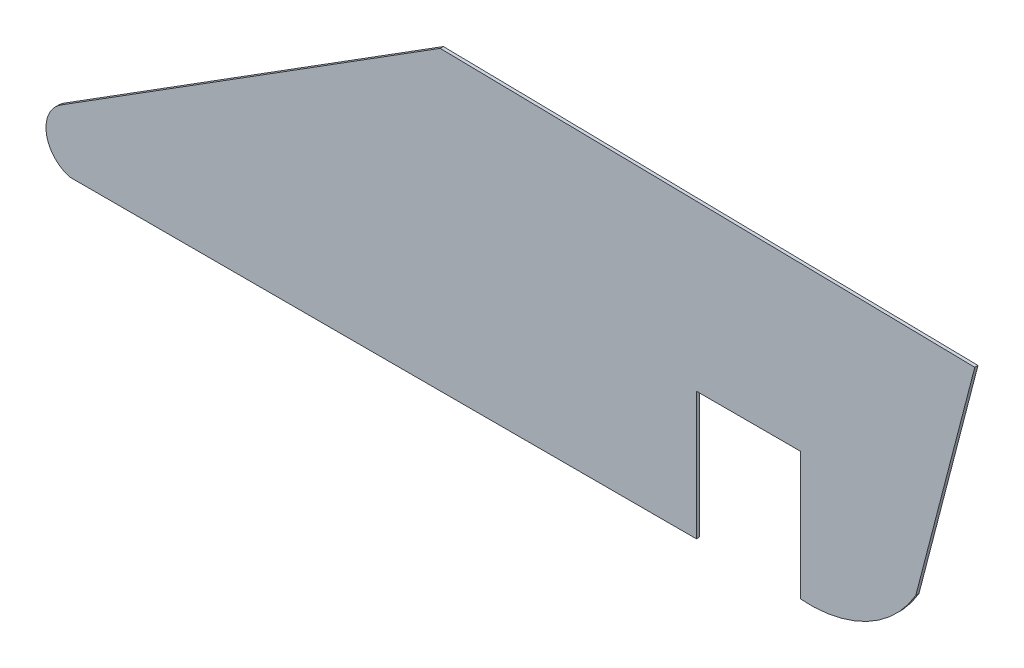
ISO-10303-21;
HEADER;
FILE_DESCRIPTION(('STEP AP214'),'2;1');
FILE_NAME('part.step','',(''),(''),'','','');
FILE_SCHEMA(('AUTOMOTIVE_DESIGN { 1 0 10303 214 1 1 1 1 }'));
ENDSEC;
DATA;
#1=APPLICATION_CONTEXT('core data for automotive mechanical design processes');
#2=APPLICATION_PROTOCOL_DEFINITION('international standard','automotive_design',2000,#1);
#3=PRODUCT_CONTEXT('',#1,'mechanical');
#4=PRODUCT('Part','Part','',(#3));
#5=PRODUCT_RELATED_PRODUCT_CATEGORY('part','',(#4));
#6=PRODUCT_DEFINITION_FORMATION('','',#4);
#7=PRODUCT_DEFINITION_CONTEXT('part definition',#1,'design');
#8=PRODUCT_DEFINITION('design','',#6,#7);
#9=PRODUCT_DEFINITION_SHAPE('','',#8);
#10=(LENGTH_UNIT() NAMED_UNIT(*) SI_UNIT(.MILLI.,.METRE.));
#11=(NAMED_UNIT(*) PLANE_ANGLE_UNIT() SI_UNIT($,.RADIAN.));
#12=(NAMED_UNIT(*) SI_UNIT($,.STERADIAN.) SOLID_ANGLE_UNIT());
#13=UNCERTAINTY_MEASURE_WITH_UNIT(LENGTH_MEASURE(1.E-05),#10,'distance_accuracy_value','');
#14=(GEOMETRIC_REPRESENTATION_CONTEXT(3) GLOBAL_UNCERTAINTY_ASSIGNED_CONTEXT((#13)) GLOBAL_UNIT_ASSIGNED_CONTEXT((#10,
#11,#12)) REPRESENTATION_CONTEXT('',''));
#15=CARTESIAN_POINT('',(0.,0.,0.));
#16=DIRECTION('',(0.,0.,1.));
#17=DIRECTION('',(1.,0.,0.));
#18=AXIS2_PLACEMENT_3D('',#15,#16,#17);
#19=CARTESIAN_POINT('',(27.7721518519328,3.37239026571582E-13,0.1));
#20=DIRECTION('',(1.,0.,0.));
#21=DIRECTION('',(0.,1.,0.));
#22=AXIS2_PLACEMENT_3D('',#19,#20,#21);
#23=PLANE('',#22);
#24=DIRECTION('',(0.,-1.,0.));
#25=VECTOR('',#24,1.);
#26=CARTESIAN_POINT('',(27.7721518519328,3.37239026571582E-13,0.));
#27=LINE('',#26,#25);
#28=CARTESIAN_POINT('',(27.7721518519329,-4.82676172528237,0.));
#29=VERTEX_POINT('',#28);
#30=CARTESIAN_POINT('',(27.7721518519329,-8.82676172528239,0.));
#31=VERTEX_POINT('',#30);
#32=EDGE_CURVE('E135',#29,#31,#27,.T.);
#33=ORIENTED_EDGE('',*,*,#32,.T.);
#34=DIRECTION('',(0.,0.,-1.));
#35=VECTOR('',#34,1.);
#36=CARTESIAN_POINT('',(27.7721518519329,-8.82676172528239,0.1));
#37=LINE('',#36,#35);
#38=CARTESIAN_POINT('',(27.7721518519329,-8.82676172528239,0.1));
#39=VERTEX_POINT('',#38);
#40=EDGE_CURVE('E11',#39,#31,#37,.T.);
#41=ORIENTED_EDGE('',*,*,#40,.F.);
#42=DIRECTION('',(0.,-1.,0.));
#43=VECTOR('',#42,1.);
#44=CARTESIAN_POINT('',(27.7721518519328,3.37239026571582E-13,0.1));
#45=LINE('',#44,#43);
#46=CARTESIAN_POINT('',(27.7721518519329,-4.82676172528237,0.1));
#47=VERTEX_POINT('',#46);
#48=EDGE_CURVE('E153',#47,#39,#45,.T.);
#49=ORIENTED_EDGE('',*,*,#48,.F.);
#50=DIRECTION('',(0.,0.,-1.));
#51=VECTOR('',#50,1.);
#52=CARTESIAN_POINT('',(27.7721518519329,-4.82676172528237,0.1));
#53=LINE('',#52,#51);
#54=EDGE_CURVE('E131',#47,#29,#53,.T.);
#55=ORIENTED_EDGE('',*,*,#54,.T.);
#56=EDGE_LOOP('',(#33,#41,#49,#55));
#57=FACE_BOUND('',#56,.T.);
#58=ADVANCED_FACE('F33',(#57),#23,.F.);
#59=CARTESIAN_POINT('',(28.0730646856044,-5.01623309485571,0.1));
#60=DIRECTION('',(0.,0.,-1.));
#61=DIRECTION('',(-1.,0.,0.));
#62=AXIS2_PLACEMENT_3D('',#59,#60,#61);
#63=CYLINDRICAL_SURFACE('',#62,3.82239152583427);
#64=CARTESIAN_POINT('',(28.0730646856044,-5.01623309485571,0.));
#65=DIRECTION('',(0.,0.,1.));
#66=DIRECTION('',(1.,0.,0.));
#67=AXIS2_PLACEMENT_3D('',#64,#65,#66);
#68=CIRCLE('',#67,3.82239152583427);
#69=CARTESIAN_POINT('',(31.38310402269,-6.92785977486299,0.));
#70=VERTEX_POINT('',#69);
#71=EDGE_CURVE('E138',#31,#70,#68,.T.);
#72=ORIENTED_EDGE('',*,*,#71,.T.);
#73=DIRECTION('',(0.,0.,-1.));
#74=VECTOR('',#73,1.);
#75=CARTESIAN_POINT('',(31.38310402269,-6.92785977486299,0.1));
#76=LINE('',#75,#74);
#77=CARTESIAN_POINT('',(31.38310402269,-6.92785977486299,0.1));
#78=VERTEX_POINT('',#77);
#79=EDGE_CURVE('E41',#78,#70,#76,.T.);
#80=ORIENTED_EDGE('',*,*,#79,.F.);
#81=CARTESIAN_POINT('',(28.0730646856044,-5.01623309485571,0.1));
#82=DIRECTION('',(0.,0.,1.));
#83=DIRECTION('',(1.,0.,0.));
#84=AXIS2_PLACEMENT_3D('',#81,#82,#83);
#85=CIRCLE('',#84,3.82239152583427);
#86=EDGE_CURVE('E95',#39,#78,#85,.T.);
#87=ORIENTED_EDGE('',*,*,#86,.F.);
#88=ORIENTED_EDGE('',*,*,#40,.T.);
#89=EDGE_LOOP('',(#72,#80,#87,#88));
#90=FACE_BOUND('',#89,.T.);
#91=ADVANCED_FACE('F191',(#90),#63,.T.);
#92=CARTESIAN_POINT('',(31.0838551293052,-8.07918930750944,0.1));
#93=DIRECTION('',(-0.967842318066354,0.251557642221312,0.));
#94=DIRECTION('',(-0.251557642221312,-0.967842318066354,0.));
#95=AXIS2_PLACEMENT_3D('',#92,#93,#94);
#96=PLANE('',#95);
#97=DIRECTION('',(0.251557642221312,0.967842318066354,0.));
#98=VECTOR('',#97,1.);
#99=CARTESIAN_POINT('',(31.0838551293052,-8.07918930750944,0.));
#100=LINE('',#99,#98);
#101=CARTESIAN_POINT('',(33.2289738475286,0.173935719582353,0.));
#102=VERTEX_POINT('',#101);
#103=EDGE_CURVE('E140',#70,#102,#100,.T.);
#104=ORIENTED_EDGE('',*,*,#103,.T.);
#105=DIRECTION('',(0.,0.,-1.));
#106=VECTOR('',#105,1.);
#107=CARTESIAN_POINT('',(33.2289738475286,0.173935719582353,0.1));
#108=LINE('',#107,#106);
#109=CARTESIAN_POINT('',(33.2289738475286,0.173935719582353,0.1));
#110=VERTEX_POINT('',#109);
#111=EDGE_CURVE('E162',#110,#102,#108,.T.);
#112=ORIENTED_EDGE('',*,*,#111,.F.);
#113=DIRECTION('',(0.251557642221312,0.967842318066354,0.));
#114=VECTOR('',#113,1.);
#115=CARTESIAN_POINT('',(31.0838551293052,-8.07918930750944,0.1));
#116=LINE('',#115,#114);
#117=EDGE_CURVE('E169',#78,#110,#116,.T.);
#118=ORIENTED_EDGE('',*,*,#117,.F.);
#119=ORIENTED_EDGE('',*,*,#79,.T.);
#120=EDGE_LOOP('',(#104,#112,#118,#119));
#121=FACE_BOUND('',#120,.T.);
#122=ADVANCED_FACE('F167',(#121),#96,.F.);
#123=CARTESIAN_POINT('',(0.0120882506475251,0.726575120117327,0.1));
#124=DIRECTION('',(0.0166350011816528,0.999861628794548,0.));
#125=DIRECTION('',(-0.999861628794548,0.0166350011816528,0.));
#126=AXIS2_PLACEMENT_3D('',#123,#124,#125);
#127=PLANE('',#126);
#128=DIRECTION('',(0.999861628794548,-0.0166350011816528,0.));
#129=VECTOR('',#128,1.);
#130=CARTESIAN_POINT('',(0.0120882506475251,0.726575120117327,0.));
#131=LINE('',#130,#129);
#132=CARTESIAN_POINT('',(16.5106904278303,0.452082871580956,0.));
#133=VERTEX_POINT('',#132);
#134=EDGE_CURVE('E143',#133,#102,#131,.T.);
#135=ORIENTED_EDGE('',*,*,#134,.F.);
#136=DIRECTION('',(0.,0.,-1.));
#137=VECTOR('',#136,1.);
#138=CARTESIAN_POINT('',(16.5106904278303,0.452082871580956,0.1));
#139=LINE('',#138,#137);
#140=CARTESIAN_POINT('',(16.5106904278303,0.452082871580956,0.1));
#141=VERTEX_POINT('',#140);
#142=EDGE_CURVE('E160',#141,#133,#139,.T.);
#143=ORIENTED_EDGE('',*,*,#142,.F.);
#144=DIRECTION('',(0.999861628794548,-0.0166350011816528,0.));
#145=VECTOR('',#144,1.);
#146=CARTESIAN_POINT('',(0.0120882506475251,0.726575120117327,0.1));
#147=LINE('',#146,#145);
#148=EDGE_CURVE('E181',#141,#110,#147,.T.);
#149=ORIENTED_EDGE('',*,*,#148,.T.);
#150=ORIENTED_EDGE('',*,*,#111,.T.);
#151=EDGE_LOOP('',(#135,#143,#149,#150));
#152=FACE_BOUND('',#151,.T.);
#153=ADVANCED_FACE('F177',(#152),#127,.T.);
#154=CARTESIAN_POINT('',(4.47925060287593,-7.11854356406394,0.1));
#155=DIRECTION('',(0.532575241049156,-0.846382663233028,0.));
#156=DIRECTION('',(0.846382663233028,0.532575241049156,0.));
#157=AXIS2_PLACEMENT_3D('',#154,#155,#156);
#158=PLANE('',#157);
#159=DIRECTION('',(-0.846382663233028,-0.532575241049156,0.));
#160=VECTOR('',#159,1.);
#161=CARTESIAN_POINT('',(4.47925060287593,-7.11854356406394,0.));
#162=LINE('',#161,#160);
#163=CARTESIAN_POINT('',(4.6495583753276,-7.01137962166993,0.));
#164=VERTEX_POINT('',#163);
#165=EDGE_CURVE('E146',#133,#164,#162,.T.);
#166=ORIENTED_EDGE('',*,*,#165,.T.);
#167=DIRECTION('',(0.,0.,-1.));
#168=VECTOR('',#167,1.);
#169=CARTESIAN_POINT('',(4.6495583753276,-7.01137962166993,0.1));
#170=LINE('',#169,#168);
#171=CARTESIAN_POINT('',(4.6495583753276,-7.01137962166993,0.1));
#172=VERTEX_POINT('',#171);
#173=EDGE_CURVE('E157',#172,#164,#170,.T.);
#174=ORIENTED_EDGE('',*,*,#173,.F.);
#175=DIRECTION('',(-0.846382663233028,-0.532575241049156,0.));
#176=VECTOR('',#175,1.);
#177=CARTESIAN_POINT('',(4.47925060287593,-7.11854356406394,0.1));
#178=LINE('',#177,#176);
#179=EDGE_CURVE('E182',#141,#172,#178,.T.);
#180=ORIENTED_EDGE('',*,*,#179,.F.);
#181=ORIENTED_EDGE('',*,*,#142,.T.);
#182=EDGE_LOOP('',(#166,#174,#180,#181));
#183=FACE_BOUND('',#182,.T.);
#184=ADVANCED_FACE('F201',(#183),#158,.F.);
#185=CARTESIAN_POINT('',(5.18213361637676,-7.85776228490296,0.1));
#186=DIRECTION('',(0.,0.,-1.));
#187=DIRECTION('',(-1.,0.,0.));
#188=AXIS2_PLACEMENT_3D('',#185,#186,#187);
#189=CYLINDRICAL_SURFACE('',#188,1.);
#190=CARTESIAN_POINT('',(5.18213361637676,-7.85776228490296,0.));
#191=DIRECTION('',(0.,0.,1.));
#192=DIRECTION('',(1.,0.,0.));
#193=AXIS2_PLACEMENT_3D('',#190,#191,#192);
#194=CIRCLE('',#193,1.);
#195=CARTESIAN_POINT('',(4.93507070020949,-8.82676172528202,0.));
#196=VERTEX_POINT('',#195);
#197=EDGE_CURVE('E148',#164,#196,#194,.T.);
#198=ORIENTED_EDGE('',*,*,#197,.T.);
#199=DIRECTION('',(0.,0.,-1.));
#200=VECTOR('',#199,1.);
#201=CARTESIAN_POINT('',(4.93507070020949,-8.82676172528202,0.1));
#202=LINE('',#201,#200);
#203=CARTESIAN_POINT('',(4.93507070020949,-8.82676172528202,0.1));
#204=VERTEX_POINT('',#203);
#205=EDGE_CURVE('E126',#204,#196,#202,.T.);
#206=ORIENTED_EDGE('',*,*,#205,.F.);
#207=CARTESIAN_POINT('',(5.18213361637676,-7.85776228490296,0.1));
#208=DIRECTION('',(0.,0.,1.));
#209=DIRECTION('',(1.,0.,0.));
#210=AXIS2_PLACEMENT_3D('',#207,#208,#209);
#211=CIRCLE('',#210,1.);
#212=EDGE_CURVE('E117',#172,#204,#211,.T.);
#213=ORIENTED_EDGE('',*,*,#212,.F.);
#214=ORIENTED_EDGE('',*,*,#173,.T.);
#215=EDGE_LOOP('',(#198,#206,#213,#214));
#216=FACE_BOUND('',#215,.T.);
#217=ADVANCED_FACE('F204',(#216),#189,.T.);
#218=CARTESIAN_POINT('',(-1.63383510211972E-13,-8.82676172528192,0.1));
#219=DIRECTION('',(0.,1.,0.));
#220=DIRECTION('',(-1.,0.,0.));
#221=AXIS2_PLACEMENT_3D('',#218,#219,#220);
#222=PLANE('',#221);
#223=DIRECTION('',(1.,0.,0.));
#224=VECTOR('',#223,1.);
#225=CARTESIAN_POINT('',(-1.63383510211972E-13,-8.82676172528192,0.));
#226=LINE('',#225,#224);
#227=CARTESIAN_POINT('',(24.5221518519329,-8.82676172528238,0.));
#228=VERTEX_POINT('',#227);
#229=EDGE_CURVE('E125',#196,#228,#226,.T.);
#230=ORIENTED_EDGE('',*,*,#229,.T.);
#231=DIRECTION('',(0.,0.,-1.));
#232=VECTOR('',#231,1.);
#233=CARTESIAN_POINT('',(24.5221518519329,-8.82676172528238,0.1));
#234=LINE('',#233,#232);
#235=CARTESIAN_POINT('',(24.5221518519329,-8.82676172528238,0.1));
#236=VERTEX_POINT('',#235);
#237=EDGE_CURVE('E122',#236,#228,#234,.T.);
#238=ORIENTED_EDGE('',*,*,#237,.F.);
#239=DIRECTION('',(1.,0.,0.));
#240=VECTOR('',#239,1.);
#241=CARTESIAN_POINT('',(-1.63383510211972E-13,-8.82676172528192,0.1));
#242=LINE('',#241,#240);
#243=EDGE_CURVE('E111',#204,#236,#242,.T.);
#244=ORIENTED_EDGE('',*,*,#243,.F.);
#245=ORIENTED_EDGE('',*,*,#205,.T.);
#246=EDGE_LOOP('',(#230,#238,#244,#245));
#247=FACE_BOUND('',#246,.T.);
#248=ADVANCED_FACE('F123',(#247),#222,.F.);
#249=CARTESIAN_POINT('',(24.5221518519329,0.,0.1));
#250=DIRECTION('',(-1.,0.,0.));
#251=DIRECTION('',(0.,-1.,0.));
#252=AXIS2_PLACEMENT_3D('',#249,#250,#251);
#253=PLANE('',#252);
#254=DIRECTION('',(0.,1.,0.));
#255=VECTOR('',#254,1.);
#256=CARTESIAN_POINT('',(24.5221518519329,0.,0.));
#257=LINE('',#256,#255);
#258=CARTESIAN_POINT('',(24.5221518519329,-4.82676172528238,0.));
#259=VERTEX_POINT('',#258);
#260=EDGE_CURVE('E81',#228,#259,#257,.T.);
#261=ORIENTED_EDGE('',*,*,#260,.T.);
#262=DIRECTION('',(0.,0.,-1.));
#263=VECTOR('',#262,1.);
#264=CARTESIAN_POINT('',(24.5221518519329,-4.82676172528238,0.1));
#265=LINE('',#264,#263);
#266=CARTESIAN_POINT('',(24.5221518519329,-4.82676172528238,0.1));
#267=VERTEX_POINT('',#266);
#268=EDGE_CURVE('E127',#267,#259,#265,.T.);
#269=ORIENTED_EDGE('',*,*,#268,.F.);
#270=DIRECTION('',(0.,1.,0.));
#271=VECTOR('',#270,1.);
#272=CARTESIAN_POINT('',(24.5221518519329,0.,0.1));
#273=LINE('',#272,#271);
#274=EDGE_CURVE('E115',#236,#267,#273,.T.);
#275=ORIENTED_EDGE('',*,*,#274,.F.);
#276=ORIENTED_EDGE('',*,*,#237,.T.);
#277=EDGE_LOOP('',(#261,#269,#275,#276));
#278=FACE_BOUND('',#277,.T.);
#279=ADVANCED_FACE('F129',(#278),#253,.F.);
#280=CARTESIAN_POINT('',(0.,-4.82676172528249,0.1));
#281=DIRECTION('',(0.,1.,0.));
#282=DIRECTION('',(-1.,0.,0.));
#283=AXIS2_PLACEMENT_3D('',#280,#281,#282);
#284=PLANE('',#283);
#285=DIRECTION('',(1.,0.,0.));
#286=VECTOR('',#285,1.);
#287=CARTESIAN_POINT('',(0.,-4.82676172528249,0.));
#288=LINE('',#287,#286);
#289=EDGE_CURVE('E87',#259,#29,#288,.T.);
#290=ORIENTED_EDGE('',*,*,#289,.T.);
#291=ORIENTED_EDGE('',*,*,#54,.F.);
#292=DIRECTION('',(1.,0.,0.));
#293=VECTOR('',#292,1.);
#294=CARTESIAN_POINT('',(0.,-4.82676172528249,0.1));
#295=LINE('',#294,#293);
#296=EDGE_CURVE('E49',#267,#47,#295,.T.);
#297=ORIENTED_EDGE('',*,*,#296,.F.);
#298=ORIENTED_EDGE('',*,*,#268,.T.);
#299=EDGE_LOOP('',(#290,#291,#297,#298));
#300=FACE_BOUND('',#299,.T.);
#301=ADVANCED_FACE('F213',(#300),#284,.F.);
#302=CARTESIAN_POINT('',(0.,0.,0.1));
#303=DIRECTION('',(0.,0.,1.));
#304=DIRECTION('',(1.,0.,0.));
#305=AXIS2_PLACEMENT_3D('',#302,#303,#304);
#306=PLANE('',#305);
#307=ORIENTED_EDGE('',*,*,#48,.T.);
#308=ORIENTED_EDGE('',*,*,#86,.T.);
#309=ORIENTED_EDGE('',*,*,#117,.T.);
#310=ORIENTED_EDGE('',*,*,#148,.F.);
#311=ORIENTED_EDGE('',*,*,#179,.T.);
#312=ORIENTED_EDGE('',*,*,#212,.T.);
#313=ORIENTED_EDGE('',*,*,#243,.T.);
#314=ORIENTED_EDGE('',*,*,#274,.T.);
#315=ORIENTED_EDGE('',*,*,#296,.T.);
#316=EDGE_LOOP('',(#307,#308,#309,#310,#311,#312,#313,#314,#315));
#317=FACE_BOUND('',#316,.T.);
#318=ADVANCED_FACE('F113',(#317),#306,.T.);
#319=CARTESIAN_POINT('',(0.,0.,0.));
#320=DIRECTION('',(0.,0.,1.));
#321=DIRECTION('',(1.,0.,0.));
#322=AXIS2_PLACEMENT_3D('',#319,#320,#321);
#323=PLANE('',#322);
#324=ORIENTED_EDGE('',*,*,#32,.F.);
#325=ORIENTED_EDGE('',*,*,#289,.F.);
#326=ORIENTED_EDGE('',*,*,#260,.F.);
#327=ORIENTED_EDGE('',*,*,#229,.F.);
#328=ORIENTED_EDGE('',*,*,#197,.F.);
#329=ORIENTED_EDGE('',*,*,#165,.F.);
#330=ORIENTED_EDGE('',*,*,#134,.T.);
#331=ORIENTED_EDGE('',*,*,#103,.F.);
#332=ORIENTED_EDGE('',*,*,#71,.F.);
#333=EDGE_LOOP('',(#324,#325,#326,#327,#328,#329,#330,#331,#332));
#334=FACE_BOUND('',#333,.T.);
#335=ADVANCED_FACE('F172',(#334),#323,.F.);
#336=CLOSED_SHELL('',(#58,#91,#122,#153,#184,#217,#248,#279,#301,#318,#335));
#337=MANIFOLD_SOLID_BREP('B2',#336);
#338=ADVANCED_BREP_SHAPE_REPRESENTATION('',(#18,#337),#14);
#339=SHAPE_DEFINITION_REPRESENTATION(#9,#338);
ENDSEC;
END-ISO-10303-21;
